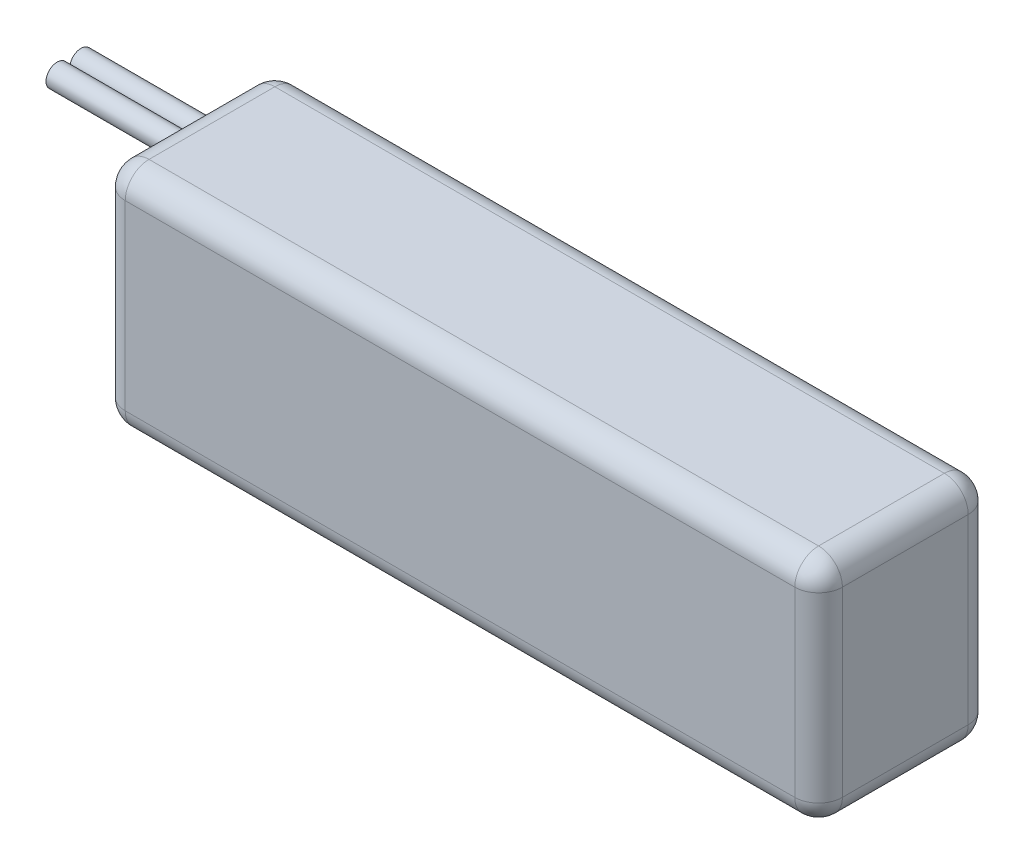
ISO-10303-21;
HEADER;
FILE_DESCRIPTION(('STEP AP214'),'2;1');
FILE_NAME('part.step','',(''),(''),'','','');
FILE_SCHEMA(('AUTOMOTIVE_DESIGN { 1 0 10303 214 1 1 1 1 }'));
ENDSEC;
DATA;
#1=APPLICATION_CONTEXT('core data for automotive mechanical design processes');
#2=APPLICATION_PROTOCOL_DEFINITION('international standard','automotive_design',2000,#1);
#3=PRODUCT_CONTEXT('',#1,'mechanical');
#4=PRODUCT('Part','Part','',(#3));
#5=PRODUCT_RELATED_PRODUCT_CATEGORY('part','',(#4));
#6=PRODUCT_DEFINITION_FORMATION('','',#4);
#7=PRODUCT_DEFINITION_CONTEXT('part definition',#1,'design');
#8=PRODUCT_DEFINITION('design','',#6,#7);
#9=PRODUCT_DEFINITION_SHAPE('','',#8);
#10=(LENGTH_UNIT() NAMED_UNIT(*) SI_UNIT(.MILLI.,.METRE.));
#11=(NAMED_UNIT(*) PLANE_ANGLE_UNIT() SI_UNIT($,.RADIAN.));
#12=(NAMED_UNIT(*) SI_UNIT($,.STERADIAN.) SOLID_ANGLE_UNIT());
#13=UNCERTAINTY_MEASURE_WITH_UNIT(LENGTH_MEASURE(1.E-05),#10,'distance_accuracy_value','');
#14=(GEOMETRIC_REPRESENTATION_CONTEXT(3) GLOBAL_UNCERTAINTY_ASSIGNED_CONTEXT((#13)) GLOBAL_UNIT_ASSIGNED_CONTEXT((#10,
#11,#12)) REPRESENTATION_CONTEXT('',''));
#15=CARTESIAN_POINT('',(0.,0.,0.));
#16=DIRECTION('',(0.,0.,1.));
#17=DIRECTION('',(1.,0.,0.));
#18=AXIS2_PLACEMENT_3D('',#15,#16,#17);
#19=CARTESIAN_POINT('',(0.,49.,0.));
#20=DIRECTION('',(1.,0.,0.));
#21=DIRECTION('',(0.,0.,-1.));
#22=AXIS2_PLACEMENT_3D('',#19,#20,#21);
#23=PLANE('',#22);
#24=DIRECTION('',(0.,0.,1.));
#25=VECTOR('',#24,1.);
#26=CARTESIAN_POINT('',(0.,43.92,0.));
#27=LINE('',#26,#25);
#28=CARTESIAN_POINT('',(0.,43.92,31.92));
#29=VERTEX_POINT('',#28);
#30=CARTESIAN_POINT('',(0.,43.92,23.42125));
#31=VERTEX_POINT('',#30);
#32=EDGE_CURVE('E141',#29,#31,#27,.F.);
#33=ORIENTED_EDGE('',*,*,#32,.T.);
#34=CARTESIAN_POINT('',(0.,43.92,21.04));
#35=DIRECTION('',(1.,0.,0.));
#36=DIRECTION('',(0.,0.,-1.));
#37=AXIS2_PLACEMENT_3D('',#34,#35,#36);
#38=CIRCLE('',#37,2.38125);
#39=CARTESIAN_POINT('',(0.,43.92,18.65875));
#40=VERTEX_POINT('',#39);
#41=EDGE_CURVE('E145',#31,#40,#38,.T.);
#42=ORIENTED_EDGE('',*,*,#41,.T.);
#43=CARTESIAN_POINT('',(0.,43.92,18.34125));
#44=VERTEX_POINT('',#43);
#45=EDGE_CURVE('E60',#40,#44,#27,.F.);
#46=ORIENTED_EDGE('',*,*,#45,.T.);
#47=CARTESIAN_POINT('',(0.,43.92,15.96));
#48=DIRECTION('',(1.,0.,0.));
#49=DIRECTION('',(0.,0.,-1.));
#50=AXIS2_PLACEMENT_3D('',#47,#48,#49);
#51=CIRCLE('',#50,2.38125);
#52=CARTESIAN_POINT('',(0.,43.92,13.57875));
#53=VERTEX_POINT('',#52);
#54=EDGE_CURVE('E338',#44,#53,#51,.T.);
#55=ORIENTED_EDGE('',*,*,#54,.T.);
#56=CARTESIAN_POINT('',(0.,43.92,5.08));
#57=VERTEX_POINT('',#56);
#58=EDGE_CURVE('E142',#53,#57,#27,.F.);
#59=ORIENTED_EDGE('',*,*,#58,.T.);
#60=DIRECTION('',(0.,-1.,0.));
#61=VECTOR('',#60,1.);
#62=CARTESIAN_POINT('',(0.,49.,5.08));
#63=LINE('',#62,#61);
#64=CARTESIAN_POINT('',(0.,5.08,5.08));
#65=VERTEX_POINT('',#64);
#66=EDGE_CURVE('E331',#57,#65,#63,.T.);
#67=ORIENTED_EDGE('',*,*,#66,.T.);
#68=DIRECTION('',(0.,0.,1.));
#69=VECTOR('',#68,1.);
#70=CARTESIAN_POINT('',(0.,5.08,0.));
#71=LINE('',#70,#69);
#72=CARTESIAN_POINT('',(0.,5.08,31.92));
#73=VERTEX_POINT('',#72);
#74=EDGE_CURVE('E246',#65,#73,#71,.T.);
#75=ORIENTED_EDGE('',*,*,#74,.T.);
#76=DIRECTION('',(0.,-1.,0.));
#77=VECTOR('',#76,1.);
#78=CARTESIAN_POINT('',(0.,49.,31.92));
#79=LINE('',#78,#77);
#80=EDGE_CURVE('E329',#73,#29,#79,.F.);
#81=ORIENTED_EDGE('',*,*,#80,.T.);
#82=EDGE_LOOP('',(#33,#42,#46,#55,#59,#67,#75,#81));
#83=FACE_BOUND('',#82,.T.);
#84=ADVANCED_FACE('F36',(#83),#23,.F.);
#85=CARTESIAN_POINT('',(0.,49.,37.));
#86=DIRECTION('',(0.,0.,-1.));
#87=DIRECTION('',(-1.,0.,0.));
#88=AXIS2_PLACEMENT_3D('',#85,#86,#87);
#89=PLANE('',#88);
#90=DIRECTION('',(1.,0.,0.));
#91=VECTOR('',#90,1.);
#92=CARTESIAN_POINT('',(0.,5.08,37.));
#93=LINE('',#92,#91);
#94=CARTESIAN_POINT('',(5.08,5.08,37.));
#95=VERTEX_POINT('',#94);
#96=CARTESIAN_POINT('',(147.92,5.08,37.));
#97=VERTEX_POINT('',#96);
#98=EDGE_CURVE('E303',#95,#97,#93,.T.);
#99=ORIENTED_EDGE('',*,*,#98,.T.);
#100=DIRECTION('',(0.,-1.,0.));
#101=VECTOR('',#100,1.);
#102=CARTESIAN_POINT('',(147.92,49.,37.));
#103=LINE('',#102,#101);
#104=CARTESIAN_POINT('',(147.92,43.92,37.));
#105=VERTEX_POINT('',#104);
#106=EDGE_CURVE('E286',#97,#105,#103,.F.);
#107=ORIENTED_EDGE('',*,*,#106,.T.);
#108=DIRECTION('',(1.,0.,0.));
#109=VECTOR('',#108,1.);
#110=CARTESIAN_POINT('',(0.,43.92,37.));
#111=LINE('',#110,#109);
#112=CARTESIAN_POINT('',(5.08,43.92,37.));
#113=VERTEX_POINT('',#112);
#114=EDGE_CURVE('E308',#105,#113,#111,.F.);
#115=ORIENTED_EDGE('',*,*,#114,.T.);
#116=DIRECTION('',(0.,-1.,0.));
#117=VECTOR('',#116,1.);
#118=CARTESIAN_POINT('',(5.08,49.,37.));
#119=LINE('',#118,#117);
#120=EDGE_CURVE('E301',#113,#95,#119,.T.);
#121=ORIENTED_EDGE('',*,*,#120,.T.);
#122=EDGE_LOOP('',(#99,#107,#115,#121));
#123=FACE_BOUND('',#122,.T.);
#124=ADVANCED_FACE('F167',(#123),#89,.F.);
#125=CARTESIAN_POINT('',(153.,49.,0.));
#126=DIRECTION('',(-1.,0.,0.));
#127=DIRECTION('',(0.,0.,1.));
#128=AXIS2_PLACEMENT_3D('',#125,#126,#127);
#129=PLANE('',#128);
#130=DIRECTION('',(0.,-1.,0.));
#131=VECTOR('',#130,1.);
#132=CARTESIAN_POINT('',(153.,49.,31.92));
#133=LINE('',#132,#131);
#134=CARTESIAN_POINT('',(153.,43.92,31.92));
#135=VERTEX_POINT('',#134);
#136=CARTESIAN_POINT('',(153.,5.08,31.92));
#137=VERTEX_POINT('',#136);
#138=EDGE_CURVE('E269',#135,#137,#133,.T.);
#139=ORIENTED_EDGE('',*,*,#138,.T.);
#140=DIRECTION('',(0.,0.,-1.));
#141=VECTOR('',#140,1.);
#142=CARTESIAN_POINT('',(153.,5.08,0.));
#143=LINE('',#142,#141);
#144=CARTESIAN_POINT('',(153.,5.08,5.08));
#145=VERTEX_POINT('',#144);
#146=EDGE_CURVE('E273',#137,#145,#143,.T.);
#147=ORIENTED_EDGE('',*,*,#146,.T.);
#148=DIRECTION('',(0.,-1.,0.));
#149=VECTOR('',#148,1.);
#150=CARTESIAN_POINT('',(153.,49.,5.08));
#151=LINE('',#150,#149);
#152=CARTESIAN_POINT('',(153.,43.92,5.08));
#153=VERTEX_POINT('',#152);
#154=EDGE_CURVE('E279',#145,#153,#151,.F.);
#155=ORIENTED_EDGE('',*,*,#154,.T.);
#156=DIRECTION('',(0.,0.,-1.));
#157=VECTOR('',#156,1.);
#158=CARTESIAN_POINT('',(153.,43.92,37.));
#159=LINE('',#158,#157);
#160=EDGE_CURVE('E276',#153,#135,#159,.F.);
#161=ORIENTED_EDGE('',*,*,#160,.T.);
#162=EDGE_LOOP('',(#139,#147,#155,#161));
#163=FACE_BOUND('',#162,.T.);
#164=ADVANCED_FACE('F172',(#163),#129,.F.);
#165=CARTESIAN_POINT('',(0.,49.,0.));
#166=DIRECTION('',(0.,0.,1.));
#167=DIRECTION('',(1.,0.,0.));
#168=AXIS2_PLACEMENT_3D('',#165,#166,#167);
#169=PLANE('',#168);
#170=DIRECTION('',(-1.,0.,0.));
#171=VECTOR('',#170,1.);
#172=CARTESIAN_POINT('',(153.,43.92,0.));
#173=LINE('',#172,#171);
#174=CARTESIAN_POINT('',(5.08,43.92,0.));
#175=VERTEX_POINT('',#174);
#176=CARTESIAN_POINT('',(147.92,43.92,0.));
#177=VERTEX_POINT('',#176);
#178=EDGE_CURVE('E399',#175,#177,#173,.F.);
#179=ORIENTED_EDGE('',*,*,#178,.T.);
#180=DIRECTION('',(0.,-1.,0.));
#181=VECTOR('',#180,1.);
#182=CARTESIAN_POINT('',(147.92,49.,0.));
#183=LINE('',#182,#181);
#184=CARTESIAN_POINT('',(147.92,5.08,0.));
#185=VERTEX_POINT('',#184);
#186=EDGE_CURVE('E405',#177,#185,#183,.T.);
#187=ORIENTED_EDGE('',*,*,#186,.T.);
#188=DIRECTION('',(-1.,0.,0.));
#189=VECTOR('',#188,1.);
#190=CARTESIAN_POINT('',(0.,5.08,0.));
#191=LINE('',#190,#189);
#192=CARTESIAN_POINT('',(5.08,5.08,0.));
#193=VERTEX_POINT('',#192);
#194=EDGE_CURVE('E395',#185,#193,#191,.T.);
#195=ORIENTED_EDGE('',*,*,#194,.T.);
#196=DIRECTION('',(0.,-1.,0.));
#197=VECTOR('',#196,1.);
#198=CARTESIAN_POINT('',(5.08,49.,0.));
#199=LINE('',#198,#197);
#200=EDGE_CURVE('E390',#193,#175,#199,.F.);
#201=ORIENTED_EDGE('',*,*,#200,.T.);
#202=EDGE_LOOP('',(#179,#187,#195,#201));
#203=FACE_BOUND('',#202,.T.);
#204=ADVANCED_FACE('F257',(#203),#169,.F.);
#205=CARTESIAN_POINT('',(0.,49.,0.));
#206=DIRECTION('',(0.,1.,0.));
#207=DIRECTION('',(0.,0.,1.));
#208=AXIS2_PLACEMENT_3D('',#205,#206,#207);
#209=PLANE('',#208);
#210=DIRECTION('',(1.,0.,0.));
#211=VECTOR('',#210,1.);
#212=CARTESIAN_POINT('',(153.,49.,31.92));
#213=LINE('',#212,#211);
#214=CARTESIAN_POINT('',(5.08,49.,31.92));
#215=VERTEX_POINT('',#214);
#216=CARTESIAN_POINT('',(147.92,49.,31.92));
#217=VERTEX_POINT('',#216);
#218=EDGE_CURVE('E322',#215,#217,#213,.T.);
#219=ORIENTED_EDGE('',*,*,#218,.T.);
#220=DIRECTION('',(0.,0.,-1.));
#221=VECTOR('',#220,1.);
#222=CARTESIAN_POINT('',(147.92,49.,0.));
#223=LINE('',#222,#221);
#224=CARTESIAN_POINT('',(147.92,49.,5.08));
#225=VERTEX_POINT('',#224);
#226=EDGE_CURVE('E326',#217,#225,#223,.T.);
#227=ORIENTED_EDGE('',*,*,#226,.T.);
#228=DIRECTION('',(-1.,0.,0.));
#229=VECTOR('',#228,1.);
#230=CARTESIAN_POINT('',(0.,49.,5.08));
#231=LINE('',#230,#229);
#232=CARTESIAN_POINT('',(5.08,49.,5.08));
#233=VERTEX_POINT('',#232);
#234=EDGE_CURVE('E324',#225,#233,#231,.T.);
#235=ORIENTED_EDGE('',*,*,#234,.T.);
#236=DIRECTION('',(0.,0.,1.));
#237=VECTOR('',#236,1.);
#238=CARTESIAN_POINT('',(5.08,49.,37.));
#239=LINE('',#238,#237);
#240=EDGE_CURVE('E320',#233,#215,#239,.T.);
#241=ORIENTED_EDGE('',*,*,#240,.T.);
#242=EDGE_LOOP('',(#219,#227,#235,#241));
#243=FACE_BOUND('',#242,.T.);
#244=ADVANCED_FACE('F253',(#243),#209,.T.);
#245=CARTESIAN_POINT('',(0.,0.,0.));
#246=DIRECTION('',(0.,1.,0.));
#247=DIRECTION('',(0.,0.,1.));
#248=AXIS2_PLACEMENT_3D('',#245,#246,#247);
#249=PLANE('',#248);
#250=DIRECTION('',(-1.,0.,0.));
#251=VECTOR('',#250,1.);
#252=CARTESIAN_POINT('',(0.,0.,5.08));
#253=LINE('',#252,#251);
#254=CARTESIAN_POINT('',(5.08,0.,5.08));
#255=VERTEX_POINT('',#254);
#256=CARTESIAN_POINT('',(147.92,0.,5.08));
#257=VERTEX_POINT('',#256);
#258=EDGE_CURVE('E313',#255,#257,#253,.F.);
#259=ORIENTED_EDGE('',*,*,#258,.T.);
#260=DIRECTION('',(0.,0.,-1.));
#261=VECTOR('',#260,1.);
#262=CARTESIAN_POINT('',(147.92,0.,-1.10962290407131E-13));
#263=LINE('',#262,#261);
#264=CARTESIAN_POINT('',(147.92,0.,31.92));
#265=VERTEX_POINT('',#264);
#266=EDGE_CURVE('E317',#257,#265,#263,.F.);
#267=ORIENTED_EDGE('',*,*,#266,.T.);
#268=DIRECTION('',(1.,0.,0.));
#269=VECTOR('',#268,1.);
#270=CARTESIAN_POINT('',(0.,0.,31.92));
#271=LINE('',#270,#269);
#272=CARTESIAN_POINT('',(5.08,0.,31.92));
#273=VERTEX_POINT('',#272);
#274=EDGE_CURVE('E315',#265,#273,#271,.F.);
#275=ORIENTED_EDGE('',*,*,#274,.T.);
#276=DIRECTION('',(0.,0.,1.));
#277=VECTOR('',#276,1.);
#278=CARTESIAN_POINT('',(5.08,0.,0.));
#279=LINE('',#278,#277);
#280=EDGE_CURVE('E311',#273,#255,#279,.F.);
#281=ORIENTED_EDGE('',*,*,#280,.T.);
#282=EDGE_LOOP('',(#259,#267,#275,#281));
#283=FACE_BOUND('',#282,.T.);
#284=ADVANCED_FACE('F256',(#283),#249,.F.);
#285=CARTESIAN_POINT('',(5.08,49.,31.92));
#286=DIRECTION('',(0.,-1.,0.));
#287=DIRECTION('',(0.,0.,-1.));
#288=AXIS2_PLACEMENT_3D('',#285,#286,#287);
#289=CYLINDRICAL_SURFACE('',#288,5.08);
#290=CARTESIAN_POINT('',(5.08,43.92,31.92));
#291=DIRECTION('',(0.,1.,0.));
#292=DIRECTION('',(0.,0.,1.));
#293=AXIS2_PLACEMENT_3D('',#290,#291,#292);
#294=CIRCLE('',#293,5.08);
#295=EDGE_CURVE('E247',#29,#113,#294,.T.);
#296=ORIENTED_EDGE('',*,*,#295,.F.);
#297=ORIENTED_EDGE('',*,*,#80,.F.);
#298=CARTESIAN_POINT('',(5.08,5.08,31.92));
#299=DIRECTION('',(0.,-1.,0.));
#300=DIRECTION('',(0.,0.,-1.));
#301=AXIS2_PLACEMENT_3D('',#298,#299,#300);
#302=CIRCLE('',#301,5.08);
#303=EDGE_CURVE('E382',#95,#73,#302,.T.);
#304=ORIENTED_EDGE('',*,*,#303,.F.);
#305=ORIENTED_EDGE('',*,*,#120,.F.);
#306=EDGE_LOOP('',(#296,#297,#304,#305));
#307=FACE_BOUND('',#306,.T.);
#308=ADVANCED_FACE('F38',(#307),#289,.T.);
#309=CARTESIAN_POINT('',(5.08,43.92,31.92));
#310=DIRECTION('',(0.,0.,1.));
#311=DIRECTION('',(1.,0.,0.));
#312=AXIS2_PLACEMENT_3D('',#309,#310,#311);
#313=SPHERICAL_SURFACE('',#312,5.08);
#314=CARTESIAN_POINT('',(5.08,43.92,31.92));
#315=DIRECTION('',(0.,0.,1.));
#316=DIRECTION('',(1.,0.,0.));
#317=AXIS2_PLACEMENT_3D('',#314,#315,#316);
#318=CIRCLE('',#317,5.08);
#319=EDGE_CURVE('E377',#29,#215,#318,.F.);
#320=ORIENTED_EDGE('',*,*,#319,.F.);
#321=ORIENTED_EDGE('',*,*,#295,.T.);
#322=CARTESIAN_POINT('',(5.08,43.92,31.92));
#323=DIRECTION('',(-1.,0.,0.));
#324=DIRECTION('',(0.,-1.,0.));
#325=AXIS2_PLACEMENT_3D('',#322,#323,#324);
#326=CIRCLE('',#325,5.08);
#327=EDGE_CURVE('E380',#215,#113,#326,.F.);
#328=ORIENTED_EDGE('',*,*,#327,.F.);
#329=EDGE_LOOP('',(#320,#321,#328));
#330=FACE_BOUND('',#329,.T.);
#331=ADVANCED_FACE('F435',(#330),#313,.T.);
#332=CARTESIAN_POINT('',(5.08,5.08,31.92));
#333=DIRECTION('',(0.,0.,1.));
#334=DIRECTION('',(1.,0.,0.));
#335=AXIS2_PLACEMENT_3D('',#332,#333,#334);
#336=SPHERICAL_SURFACE('',#335,5.08);
#337=CARTESIAN_POINT('',(5.08,5.08,31.92));
#338=DIRECTION('',(-1.,0.,0.));
#339=DIRECTION('',(0.,0.,1.));
#340=AXIS2_PLACEMENT_3D('',#337,#338,#339);
#341=CIRCLE('',#340,5.08);
#342=EDGE_CURVE('E372',#95,#273,#341,.F.);
#343=ORIENTED_EDGE('',*,*,#342,.F.);
#344=ORIENTED_EDGE('',*,*,#303,.T.);
#345=CARTESIAN_POINT('',(5.08,5.08,31.92));
#346=DIRECTION('',(0.,0.,1.));
#347=DIRECTION('',(1.,0.,0.));
#348=AXIS2_PLACEMENT_3D('',#345,#346,#347);
#349=CIRCLE('',#348,5.08);
#350=EDGE_CURVE('E375',#273,#73,#349,.F.);
#351=ORIENTED_EDGE('',*,*,#350,.F.);
#352=EDGE_LOOP('',(#343,#344,#351));
#353=FACE_BOUND('',#352,.T.);
#354=ADVANCED_FACE('F437',(#353),#336,.T.);
#355=CARTESIAN_POINT('',(0.,43.92,31.92));
#356=DIRECTION('',(-1.,0.,0.));
#357=DIRECTION('',(0.,0.,1.));
#358=AXIS2_PLACEMENT_3D('',#355,#356,#357);
#359=CYLINDRICAL_SURFACE('',#358,5.08);
#360=ORIENTED_EDGE('',*,*,#327,.T.);
#361=ORIENTED_EDGE('',*,*,#114,.F.);
#362=CARTESIAN_POINT('',(147.92,43.92,31.92));
#363=DIRECTION('',(1.,0.,0.));
#364=DIRECTION('',(0.,0.,-1.));
#365=AXIS2_PLACEMENT_3D('',#362,#363,#364);
#366=CIRCLE('',#365,5.08);
#367=EDGE_CURVE('E368',#217,#105,#366,.T.);
#368=ORIENTED_EDGE('',*,*,#367,.F.);
#369=ORIENTED_EDGE('',*,*,#218,.F.);
#370=EDGE_LOOP('',(#360,#361,#368,#369));
#371=FACE_BOUND('',#370,.T.);
#372=ADVANCED_FACE('F239',(#371),#359,.T.);
#373=CARTESIAN_POINT('',(5.08,43.92,0.));
#374=DIRECTION('',(0.,0.,-1.));
#375=DIRECTION('',(-1.,0.,0.));
#376=AXIS2_PLACEMENT_3D('',#373,#374,#375);
#377=CYLINDRICAL_SURFACE('',#376,5.08);
#378=CARTESIAN_POINT('',(0.,43.92,23.42125));
#379=CARTESIAN_POINT('',(6.66751126377111E-06,44.0461030678718,23.4212419566849));
#380=CARTESIAN_POINT('',(0.00474750865264298,44.1723880812394,23.4111732828898));
#381=CARTESIAN_POINT('',(0.023244636523619,44.4212810356049,23.3713142884802));
#382=CARTESIAN_POINT('',(0.0370207261469717,44.5438802796551,23.3414806467847));
#383=CARTESIAN_POINT('',(0.0721336023674859,44.7814148021554,23.2634839952844));
#384=CARTESIAN_POINT('',(0.0934422842846373,44.8963767073086,23.2153890709597));
#385=CARTESIAN_POINT('',(0.141619624718228,45.1164564396619,23.1025588240147));
#386=CARTESIAN_POINT('',(0.168487382233147,45.2215758581031,23.0378261975815));
#387=CARTESIAN_POINT('',(0.22698892521994,45.4255061776356,22.8894770668307));
#388=CARTESIAN_POINT('',(0.258803706965461,45.5236507428597,22.8050168571231));
#389=CARTESIAN_POINT('',(0.32295162640306,45.7049815963756,22.6214106616557));
#390=CARTESIAN_POINT('',(0.355285093125134,45.788157944948,22.5222549964041));
#391=CARTESIAN_POINT('',(0.419239964560849,45.9426632319388,22.3041951583329));
#392=CARTESIAN_POINT('',(0.450673773594214,46.0128490482213,22.1844198340709));
#393=CARTESIAN_POINT('',(0.506298986047624,46.1317867750302,21.9331072744446));
#394=CARTESIAN_POINT('',(0.530495046025748,46.1805524761404,21.8015776725026));
#395=CARTESIAN_POINT('',(0.566894334930618,46.2523433125274,21.5380960310609));
#396=CARTESIAN_POINT('',(0.579694408171674,46.2766594470889,21.4065819632844));
#397=CARTESIAN_POINT('',(0.59350365308562,46.3028543332485,21.1407673985273));
#398=CARTESIAN_POINT('',(0.594522152656619,46.304750835307,21.006469190265));
#399=CARTESIAN_POINT('',(0.585143920979396,46.2870079049233,20.7535711448624));
#400=CARTESIAN_POINT('',(0.575899986147013,46.2695435937815,20.6347663106757));
#401=CARTESIAN_POINT('',(0.549030510462143,46.2172960960267,20.4020236671996));
#402=CARTESIAN_POINT('',(0.531402787606297,46.1825084006389,20.2880871333748));
#403=CARTESIAN_POINT('',(0.489344770274719,46.0959220904643,20.0651387166347));
#404=CARTESIAN_POINT('',(0.464766737358207,46.0437490726996,19.9563013999583));
#405=CARTESIAN_POINT('',(0.411588410976883,45.9241484869647,19.7484369304834));
#406=CARTESIAN_POINT('',(0.382986357035547,45.8567142344275,19.6494141039374));
#407=CARTESIAN_POINT('',(0.321181982915465,45.6998596690143,19.4525572054004));
#408=CARTESIAN_POINT('',(0.287819147520031,45.6088392775379,19.3560442901392));
#409=CARTESIAN_POINT('',(0.222834261713092,45.4116811789871,19.1791431789638));
#410=CARTESIAN_POINT('',(0.191212862773998,45.3055378669742,19.0987609882282));
#411=CARTESIAN_POINT('',(0.131861192473406,45.0762143149451,18.9537181470265));
#412=CARTESIAN_POINT('',(0.104313411041528,44.9525561404361,18.8897326255739));
#413=CARTESIAN_POINT('',(0.0576989511461022,44.6946082866233,18.7839579174467));
#414=CARTESIAN_POINT('',(0.0386263277348119,44.5603261377046,18.7421531679371));
#415=CARTESIAN_POINT('',(0.012314025111575,44.2958533832674,18.685009207939));
#416=CARTESIAN_POINT('',(0.00428786190068203,44.1661225969004,18.6679060602172));
#417=CARTESIAN_POINT('',(-0.00164953499662754,43.9054024801508,18.6552249693106));
#418=CARTESIAN_POINT('',(0.000435256319284717,43.7744136645569,18.6596385670848));
#419=CARTESIAN_POINT('',(0.0140021276029588,43.5240806356016,18.6887391269643));
#420=CARTESIAN_POINT('',(0.0248530905220521,43.4045395295678,18.7120649086242));
#421=CARTESIAN_POINT('',(0.0541047653893851,43.1712653541252,18.7762886590634));
#422=CARTESIAN_POINT('',(0.0725063578287522,43.0575329638201,18.817188677229));
#423=CARTESIAN_POINT('',(0.115859614462322,42.8351285751517,18.9166298922253));
#424=CARTESIAN_POINT('',(0.140994268668439,42.7267174503632,18.9756720212303));
#425=CARTESIAN_POINT('',(0.19528675270719,42.5209582170742,19.1091733111719));
#426=CARTESIAN_POINT('',(0.224446347907857,42.4236149973919,19.1836392443135));
#427=CARTESIAN_POINT('',(0.286933433916928,42.2336504025676,19.3535196712354));
#428=CARTESIAN_POINT('',(0.320401416911226,42.1422089144573,19.4502047307659));
#429=CARTESIAN_POINT('',(0.385668578176108,41.9763924901376,19.6578264348214));
#430=CARTESIAN_POINT('',(0.417466933080163,41.9020259144623,19.7687700195787));
#431=CARTESIAN_POINT('',(0.476704215164317,41.7702382090416,20.0065818821403));
#432=CARTESIAN_POINT('',(0.503962470636643,41.7134646447281,20.1338577465442));
#433=CARTESIAN_POINT('',(0.548822429255224,41.6227332925937,20.3978614857355));
#434=CARTESIAN_POINT('',(0.56643492773741,41.5887499887673,20.5345786002166));
#435=CARTESIAN_POINT('',(0.588051007385053,41.5473876489804,20.8002725703437));
#436=CARTESIAN_POINT('',(0.593142938194965,41.5378773088053,20.9288285495007));
#437=CARTESIAN_POINT('',(0.59214883258969,41.5397480527593,21.1857266389945));
#438=CARTESIAN_POINT('',(0.586066019847235,41.5511231119002,21.3140688003229));
#439=CARTESIAN_POINT('',(0.564505159667843,41.5925165467159,21.5569381110853));
#440=CARTESIAN_POINT('',(0.549757553857693,41.6210893059697,21.6717838173011));
#441=CARTESIAN_POINT('',(0.513281456767811,41.6944327402588,21.8949930661474));
#442=CARTESIAN_POINT('',(0.491550879067994,41.7392082569697,22.0033546599173));
#443=CARTESIAN_POINT('',(0.441781889526168,41.8470610805539,22.2184301114576));
#444=CARTESIAN_POINT('',(0.413420496819863,41.9111560320376,22.3245570322692));
#445=CARTESIAN_POINT('',(0.354254349352318,42.0545920138815,22.5252043402943));
#446=CARTESIAN_POINT('',(0.323448447733663,42.1339402255398,22.6197192260214));
#447=CARTESIAN_POINT('',(0.259112531443435,42.3151389713669,22.8044123544138));
#448=CARTESIAN_POINT('',(0.225623783139015,42.4184567378506,22.8931740890071));
#449=CARTESIAN_POINT('',(0.162670668937866,42.6395708117861,23.0523188355914));
#450=CARTESIAN_POINT('',(0.13320823152119,42.7573740063546,23.1226930551372));
#451=CARTESIAN_POINT('',(0.0816539771751225,43.0042046240895,23.2423474147258));
#452=CARTESIAN_POINT('',(0.0595282287993208,43.1331767947826,23.2917249705768));
#453=CARTESIAN_POINT('',(0.0336795488105614,43.3321592185232,23.3485857569652));
#454=CARTESIAN_POINT('',(0.0262895244817493,43.399353425859,23.3646659722558));
#455=CARTESIAN_POINT('',(0.0141458685174156,43.5351013309582,23.3909510007653));
#456=CARTESIAN_POINT('',(0.00939049921135813,43.6036541017082,23.401159686685));
#457=CARTESIAN_POINT('',(0.00402660558461075,43.7136328457326,23.4126505267818));
#458=CARTESIAN_POINT('',(0.00251885237665859,43.7548239331376,23.415872903296));
#459=CARTESIAN_POINT('',(0.000504446292885419,43.8373368268763,23.420173980541));
#460=CARTESIAN_POINT('',(-2.18586284205595E-06,43.8786586358979,23.4212526369035));
#461=CARTESIAN_POINT('',(0.,43.92,23.42125));
#462=B_SPLINE_CURVE_WITH_KNOTS('',3,(#378,#379,#380,#381,#382,#383,#384,#385,#386,#387,#388,
#389,#390,#391,#392,#393,#394,#395,#396,#397,#398,#399,#400,#401,#402,#403,#404,#405,#406,#407,
#408,#409,#410,#411,#412,#413,#414,#415,#416,#417,#418,#419,#420,#421,#422,#423,#424,#425,#426,
#427,#428,#429,#430,#431,#432,#433,#434,#435,#436,#437,#438,#439,#440,#441,#442,#443,#444,#445,
#446,#447,#448,#449,#450,#451,#452,#453,#454,#455,#456,#457,#458,#459,#460,#461),.UNSPECIFIED.,
.T.,.F.,(4,2,2,2,2,2,2,2,2,2,2,2,2,2,2,2,2,2,2,2,2,2,2,2,2,2,2,2,2,2,2,2,2,2,2,2,2,2,2,2,2,4),
(0.,0.37814805797876,0.757127699429006,1.13470800922117,1.51222716958168,1.91053904626906,
2.30911445570845,2.7339762281225,3.15856406594302,3.55932352979642,3.95976567614627,
4.31939704759326,4.67912206962384,5.04715706198695,5.41535357027342,5.82392678356032,
6.23265182028176,6.65618547554391,7.07942156992264,7.4706174806857,7.8616596100476,
8.22681959872753,8.59202218141163,8.96838571289987,9.34491484780605,9.75475973263294,
10.1648048673644,10.5885198151477,11.0117595755854,11.3966557856313,11.7814409788491,
12.1376816334603,12.4940288272133,12.8740322606283,13.2542150413526,13.6730287455118,
14.0920423508026,14.5090901151527,14.7172930042089,14.925358410361,15.0493271072816,
15.1732983699419),.UNSPECIFIED.);
#463=EDGE_CURVE('E11',#31,#40,#462,.T.);
#464=ORIENTED_EDGE('',*,*,#463,.F.);
#465=ORIENTED_EDGE('',*,*,#32,.F.);
#466=ORIENTED_EDGE('',*,*,#319,.T.);
#467=ORIENTED_EDGE('',*,*,#240,.F.);
#468=CARTESIAN_POINT('',(5.08,43.92,5.08));
#469=DIRECTION('',(0.,0.,-1.));
#470=DIRECTION('',(-1.,0.,0.));
#471=AXIS2_PLACEMENT_3D('',#468,#469,#470);
#472=CIRCLE('',#471,5.08);
#473=EDGE_CURVE('E365',#57,#233,#472,.T.);
#474=ORIENTED_EDGE('',*,*,#473,.F.);
#475=ORIENTED_EDGE('',*,*,#58,.F.);
#476=CARTESIAN_POINT('',(0.,43.92,18.34125));
#477=CARTESIAN_POINT('',(6.66751126306753E-06,44.0461030678718,18.3412419566849));
#478=CARTESIAN_POINT('',(0.00474750865264296,44.1723880812394,18.3311732828898));
#479=CARTESIAN_POINT('',(0.0232446365236191,44.4212810356049,18.2913142884802));
#480=CARTESIAN_POINT('',(0.0370207261469713,44.5438802796551,18.2614806467847));
#481=CARTESIAN_POINT('',(0.0721336023674851,44.7814148021554,18.1834839952844));
#482=CARTESIAN_POINT('',(0.0934422842846366,44.8963767073086,18.1353890709597));
#483=CARTESIAN_POINT('',(0.141619624718227,45.1164564396619,18.0225588240147));
#484=CARTESIAN_POINT('',(0.168487382233146,45.2215758581031,17.9578261975815));
#485=CARTESIAN_POINT('',(0.226988925219939,45.4255061776356,17.8094770668307));
#486=CARTESIAN_POINT('',(0.25880370696546,45.5236507428597,17.7250168571231));
#487=CARTESIAN_POINT('',(0.322951626403058,45.7049815963756,17.5414106616557));
#488=CARTESIAN_POINT('',(0.355285093125133,45.788157944948,17.4422549964041));
#489=CARTESIAN_POINT('',(0.419239964560848,45.9426632319388,17.2241951583329));
#490=CARTESIAN_POINT('',(0.450673773594214,46.0128490482213,17.1044198340709));
#491=CARTESIAN_POINT('',(0.506298986047624,46.1317867750302,16.8531072744446));
#492=CARTESIAN_POINT('',(0.530495046025748,46.1805524761404,16.7215776725026));
#493=CARTESIAN_POINT('',(0.566894334930617,46.2523433125274,16.4580960310609));
#494=CARTESIAN_POINT('',(0.579694408171673,46.2766594470889,16.3265819632844));
#495=CARTESIAN_POINT('',(0.593503653085618,46.3028543332485,16.0607673985273));
#496=CARTESIAN_POINT('',(0.594522152656618,46.304750835307,15.926469190265));
#497=CARTESIAN_POINT('',(0.585143920979395,46.2870079049233,15.6735711448624));
#498=CARTESIAN_POINT('',(0.575899986147012,46.2695435937815,15.5547663106756));
#499=CARTESIAN_POINT('',(0.549030510462142,46.2172960960267,15.3220236671996));
#500=CARTESIAN_POINT('',(0.531402787606296,46.1825084006389,15.2080871333748));
#501=CARTESIAN_POINT('',(0.489344770274718,46.0959220904643,14.9851387166347));
#502=CARTESIAN_POINT('',(0.464766737358206,46.0437490726996,14.8763013999583));
#503=CARTESIAN_POINT('',(0.411588410976882,45.9241484869647,14.6684369304834));
#504=CARTESIAN_POINT('',(0.382986357035546,45.8567142344275,14.5694141039374));
#505=CARTESIAN_POINT('',(0.321181982915465,45.6998596690143,14.3725572054004));
#506=CARTESIAN_POINT('',(0.287819147520031,45.6088392775379,14.2760442901393));
#507=CARTESIAN_POINT('',(0.222834261713092,45.4116811789871,14.0991431789638));
#508=CARTESIAN_POINT('',(0.191212862773999,45.3055378669742,14.0187609882282));
#509=CARTESIAN_POINT('',(0.131861192473407,45.0762143149451,13.8737181470265));
#510=CARTESIAN_POINT('',(0.104313411041528,44.9525561404361,13.8097326255739));
#511=CARTESIAN_POINT('',(0.0576989511461015,44.6946082866233,13.7039579174467));
#512=CARTESIAN_POINT('',(0.0386263277348112,44.5603261377046,13.6621531679371));
#513=CARTESIAN_POINT('',(0.0123140251115743,44.2958533832674,13.605009207939));
#514=CARTESIAN_POINT('',(0.00428786190068108,44.1661225969004,13.5879060602172));
#515=CARTESIAN_POINT('',(-0.00164953499662833,43.9054024801508,13.5752249693106));
#516=CARTESIAN_POINT('',(0.000435256319284315,43.7744136645569,13.5796385670848));
#517=CARTESIAN_POINT('',(0.0140021276029586,43.5240806356016,13.6087391269643));
#518=CARTESIAN_POINT('',(0.0248530905220521,43.4045395295678,13.6320649086242));
#519=CARTESIAN_POINT('',(0.0541047653893848,43.1712653541252,13.6962886590634));
#520=CARTESIAN_POINT('',(0.0725063578287513,43.0575329638201,13.737188677229));
#521=CARTESIAN_POINT('',(0.115859614462322,42.8351285751517,13.8366298922253));
#522=CARTESIAN_POINT('',(0.140994268668439,42.7267174503631,13.8956720212303));
#523=CARTESIAN_POINT('',(0.19528675270719,42.5209582170741,14.0291733111719));
#524=CARTESIAN_POINT('',(0.224446347907857,42.4236149973919,14.1036392443135));
#525=CARTESIAN_POINT('',(0.286933433916927,42.2336504025676,14.2735196712354));
#526=CARTESIAN_POINT('',(0.320401416911226,42.1422089144573,14.3702047307659));
#527=CARTESIAN_POINT('',(0.385668578176107,41.9763924901376,14.5778264348214));
#528=CARTESIAN_POINT('',(0.417466933080163,41.9020259144623,14.6887700195787));
#529=CARTESIAN_POINT('',(0.476704215164317,41.7702382090416,14.9265818821403));
#530=CARTESIAN_POINT('',(0.503962470636642,41.7134646447281,15.0538577465442));
#531=CARTESIAN_POINT('',(0.548822429255223,41.6227332925937,15.3178614857355));
#532=CARTESIAN_POINT('',(0.566434927737409,41.5887499887673,15.4545786002166));
#533=CARTESIAN_POINT('',(0.588051007385052,41.5473876489804,15.7202725703437));
#534=CARTESIAN_POINT('',(0.593142938194964,41.5378773088053,15.8488285495007));
#535=CARTESIAN_POINT('',(0.592148832589689,41.5397480527593,16.1057266389945));
#536=CARTESIAN_POINT('',(0.586066019847234,41.5511231119002,16.2340688003229));
#537=CARTESIAN_POINT('',(0.564505159667842,41.5925165467159,16.4769381110853));
#538=CARTESIAN_POINT('',(0.549757553857692,41.6210893059697,16.5917838173011));
#539=CARTESIAN_POINT('',(0.513281456767809,41.6944327402588,16.8149930661474));
#540=CARTESIAN_POINT('',(0.491550879067993,41.7392082569697,16.9233546599173));
#541=CARTESIAN_POINT('',(0.441781889526166,41.8470610805539,17.1384301114576));
#542=CARTESIAN_POINT('',(0.413420496819861,41.9111560320376,17.2445570322692));
#543=CARTESIAN_POINT('',(0.354254349352316,42.0545920138816,17.4452043402943));
#544=CARTESIAN_POINT('',(0.323448447733662,42.1339402255398,17.5397192260214));
#545=CARTESIAN_POINT('',(0.259112531443434,42.3151389713669,17.7244123544138));
#546=CARTESIAN_POINT('',(0.225623783139015,42.4184567378506,17.8131740890071));
#547=CARTESIAN_POINT('',(0.162670668937867,42.6395708117861,17.9723188355914));
#548=CARTESIAN_POINT('',(0.133208231521189,42.7573740063546,18.0426930551372));
#549=CARTESIAN_POINT('',(0.081653977175122,43.0042046240895,18.1623474147258));
#550=CARTESIAN_POINT('',(0.0595282287993207,43.1331767947826,18.2117249705768));
#551=CARTESIAN_POINT('',(0.0336795488105615,43.3321592185232,18.2685857569652));
#552=CARTESIAN_POINT('',(0.0262895244817493,43.399353425859,18.2846659722558));
#553=CARTESIAN_POINT('',(0.0141458685174156,43.5351013309582,18.3109510007653));
#554=CARTESIAN_POINT('',(0.00939049921135806,43.6036541017082,18.321159686685));
#555=CARTESIAN_POINT('',(0.00402660558461052,43.7136328457326,18.3326505267818));
#556=CARTESIAN_POINT('',(0.00251885237665829,43.7548239331376,18.335872903296));
#557=CARTESIAN_POINT('',(0.000504446292884933,43.8373368268763,18.340173980541));
#558=CARTESIAN_POINT('',(-2.18586284265137E-06,43.8786586358979,18.3412526369035));
#559=CARTESIAN_POINT('',(0.,43.92,18.34125));
#560=B_SPLINE_CURVE_WITH_KNOTS('',3,(#476,#477,#478,#479,#480,#481,#482,#483,#484,#485,#486,
#487,#488,#489,#490,#491,#492,#493,#494,#495,#496,#497,#498,#499,#500,#501,#502,#503,#504,#505,
#506,#507,#508,#509,#510,#511,#512,#513,#514,#515,#516,#517,#518,#519,#520,#521,#522,#523,#524,
#525,#526,#527,#528,#529,#530,#531,#532,#533,#534,#535,#536,#537,#538,#539,#540,#541,#542,#543,
#544,#545,#546,#547,#548,#549,#550,#551,#552,#553,#554,#555,#556,#557,#558,#559),.UNSPECIFIED.,
.T.,.F.,(4,2,2,2,2,2,2,2,2,2,2,2,2,2,2,2,2,2,2,2,2,2,2,2,2,2,2,2,2,2,2,2,2,2,2,2,2,2,2,2,2,4),
(0.,0.37814805797876,0.757127699429006,1.13470800922117,1.51222716958168,1.91053904626906,
2.30911445570845,2.7339762281225,3.15856406594302,3.55932352979642,3.95976567614627,
4.31939704759326,4.67912206962384,5.04715706198695,5.41535357027342,5.82392678356032,
6.23265182028175,6.65618547554391,7.07942156992265,7.4706174806857,7.8616596100476,
8.22681959872753,8.59202218141163,8.96838571289988,9.34491484780605,9.75475973263294,
10.1648048673644,10.5885198151477,11.0117595755854,11.3966557856313,11.7814409788491,
12.1376816334603,12.4940288272133,12.8740322606283,13.2542150413526,13.6730287455118,
14.0920423508026,14.5090901151527,14.7172930042089,14.925358410361,15.0493271072816,
15.1732983699419),.UNSPECIFIED.);
#561=EDGE_CURVE('E48',#44,#53,#560,.T.);
#562=ORIENTED_EDGE('',*,*,#561,.F.);
#563=ORIENTED_EDGE('',*,*,#45,.F.);
#564=EDGE_LOOP('',(#464,#465,#466,#467,#474,#475,#562,#563));
#565=FACE_BOUND('',#564,.T.);
#566=ADVANCED_FACE('F138',(#565),#377,.T.);
#567=CARTESIAN_POINT('',(5.08,49.,5.08));
#568=DIRECTION('',(0.,-1.,0.));
#569=DIRECTION('',(0.,0.,-1.));
#570=AXIS2_PLACEMENT_3D('',#567,#568,#569);
#571=CYLINDRICAL_SURFACE('',#570,5.08);
#572=CARTESIAN_POINT('',(5.08,5.08,5.08));
#573=DIRECTION('',(0.,-1.,0.));
#574=DIRECTION('',(0.,0.,-1.));
#575=AXIS2_PLACEMENT_3D('',#572,#573,#574);
#576=CIRCLE('',#575,5.08);
#577=EDGE_CURVE('E359',#65,#193,#576,.T.);
#578=ORIENTED_EDGE('',*,*,#577,.F.);
#579=ORIENTED_EDGE('',*,*,#66,.F.);
#580=CARTESIAN_POINT('',(5.08,43.92,5.08));
#581=DIRECTION('',(0.,1.,0.));
#582=DIRECTION('',(0.,0.,1.));
#583=AXIS2_PLACEMENT_3D('',#580,#581,#582);
#584=CIRCLE('',#583,5.08);
#585=EDGE_CURVE('E362',#175,#57,#584,.T.);
#586=ORIENTED_EDGE('',*,*,#585,.F.);
#587=ORIENTED_EDGE('',*,*,#200,.F.);
#588=EDGE_LOOP('',(#578,#579,#586,#587));
#589=FACE_BOUND('',#588,.T.);
#590=ADVANCED_FACE('F232',(#589),#571,.T.);
#591=CARTESIAN_POINT('',(5.08,5.08,0.));
#592=DIRECTION('',(0.,0.,1.));
#593=DIRECTION('',(1.,0.,0.));
#594=AXIS2_PLACEMENT_3D('',#591,#592,#593);
#595=CYLINDRICAL_SURFACE('',#594,5.08);
#596=ORIENTED_EDGE('',*,*,#350,.T.);
#597=ORIENTED_EDGE('',*,*,#74,.F.);
#598=CARTESIAN_POINT('',(5.08,5.08,5.08));
#599=DIRECTION('',(0.,0.,-1.));
#600=DIRECTION('',(-1.,0.,0.));
#601=AXIS2_PLACEMENT_3D('',#598,#599,#600);
#602=CIRCLE('',#601,5.08);
#603=EDGE_CURVE('E356',#255,#65,#602,.T.);
#604=ORIENTED_EDGE('',*,*,#603,.F.);
#605=ORIENTED_EDGE('',*,*,#280,.F.);
#606=EDGE_LOOP('',(#596,#597,#604,#605));
#607=FACE_BOUND('',#606,.T.);
#608=ADVANCED_FACE('F228',(#607),#595,.T.);
#609=CARTESIAN_POINT('',(0.,5.08,31.92));
#610=DIRECTION('',(1.,0.,0.));
#611=DIRECTION('',(0.,0.,-1.));
#612=AXIS2_PLACEMENT_3D('',#609,#610,#611);
#613=CYLINDRICAL_SURFACE('',#612,5.08);
#614=ORIENTED_EDGE('',*,*,#342,.T.);
#615=ORIENTED_EDGE('',*,*,#274,.F.);
#616=CARTESIAN_POINT('',(147.92,5.08,31.92));
#617=DIRECTION('',(1.,0.,0.));
#618=DIRECTION('',(0.,0.,-1.));
#619=AXIS2_PLACEMENT_3D('',#616,#617,#618);
#620=CIRCLE('',#619,5.08);
#621=EDGE_CURVE('E289',#97,#265,#620,.T.);
#622=ORIENTED_EDGE('',*,*,#621,.F.);
#623=ORIENTED_EDGE('',*,*,#98,.F.);
#624=EDGE_LOOP('',(#614,#615,#622,#623));
#625=FACE_BOUND('',#624,.T.);
#626=ADVANCED_FACE('F224',(#625),#613,.T.);
#627=CARTESIAN_POINT('',(147.92,49.,31.92));
#628=DIRECTION('',(0.,-1.,0.));
#629=DIRECTION('',(0.,0.,-1.));
#630=AXIS2_PLACEMENT_3D('',#627,#628,#629);
#631=CYLINDRICAL_SURFACE('',#630,5.08);
#632=CARTESIAN_POINT('',(147.92,43.92,31.92));
#633=DIRECTION('',(0.,1.,0.));
#634=DIRECTION('',(0.,0.,1.));
#635=AXIS2_PLACEMENT_3D('',#632,#633,#634);
#636=CIRCLE('',#635,5.08);
#637=EDGE_CURVE('E370',#105,#135,#636,.T.);
#638=ORIENTED_EDGE('',*,*,#637,.F.);
#639=ORIENTED_EDGE('',*,*,#106,.F.);
#640=CARTESIAN_POINT('',(147.92,5.08,31.92));
#641=DIRECTION('',(0.,-1.,0.));
#642=DIRECTION('',(0.,0.,-1.));
#643=AXIS2_PLACEMENT_3D('',#640,#641,#642);
#644=CIRCLE('',#643,5.08);
#645=EDGE_CURVE('E283',#137,#97,#644,.T.);
#646=ORIENTED_EDGE('',*,*,#645,.F.);
#647=ORIENTED_EDGE('',*,*,#138,.F.);
#648=EDGE_LOOP('',(#638,#639,#646,#647));
#649=FACE_BOUND('',#648,.T.);
#650=ADVANCED_FACE('F220',(#649),#631,.T.);
#651=CARTESIAN_POINT('',(147.92,43.92,31.92));
#652=DIRECTION('',(0.,0.,1.));
#653=DIRECTION('',(1.,0.,0.));
#654=AXIS2_PLACEMENT_3D('',#651,#652,#653);
#655=SPHERICAL_SURFACE('',#654,5.08);
#656=ORIENTED_EDGE('',*,*,#367,.T.);
#657=ORIENTED_EDGE('',*,*,#637,.T.);
#658=CARTESIAN_POINT('',(147.92,43.92,31.92));
#659=DIRECTION('',(0.,0.,1.));
#660=DIRECTION('',(1.,0.,0.));
#661=AXIS2_PLACEMENT_3D('',#658,#659,#660);
#662=CIRCLE('',#661,5.08);
#663=EDGE_CURVE('E290',#217,#135,#662,.F.);
#664=ORIENTED_EDGE('',*,*,#663,.F.);
#665=EDGE_LOOP('',(#656,#657,#664));
#666=FACE_BOUND('',#665,.T.);
#667=ADVANCED_FACE('F216',(#666),#655,.T.);
#668=CARTESIAN_POINT('',(5.08,43.92,5.08));
#669=DIRECTION('',(0.,0.,1.));
#670=DIRECTION('',(1.,0.,0.));
#671=AXIS2_PLACEMENT_3D('',#668,#669,#670);
#672=SPHERICAL_SURFACE('',#671,5.08);
#673=ORIENTED_EDGE('',*,*,#585,.T.);
#674=ORIENTED_EDGE('',*,*,#473,.T.);
#675=CARTESIAN_POINT('',(5.08,43.92,5.08));
#676=DIRECTION('',(-1.,0.,0.));
#677=DIRECTION('',(0.,0.,1.));
#678=AXIS2_PLACEMENT_3D('',#675,#676,#677);
#679=CIRCLE('',#678,5.08);
#680=EDGE_CURVE('E350',#175,#233,#679,.F.);
#681=ORIENTED_EDGE('',*,*,#680,.F.);
#682=EDGE_LOOP('',(#673,#674,#681));
#683=FACE_BOUND('',#682,.T.);
#684=ADVANCED_FACE('F212',(#683),#672,.T.);
#685=CARTESIAN_POINT('',(5.08,5.08,5.08));
#686=DIRECTION('',(0.,0.,1.));
#687=DIRECTION('',(1.,0.,0.));
#688=AXIS2_PLACEMENT_3D('',#685,#686,#687);
#689=SPHERICAL_SURFACE('',#688,5.08);
#690=ORIENTED_EDGE('',*,*,#603,.T.);
#691=ORIENTED_EDGE('',*,*,#577,.T.);
#692=CARTESIAN_POINT('',(5.08,5.08,5.08));
#693=DIRECTION('',(-1.,0.,0.));
#694=DIRECTION('',(0.,0.,1.));
#695=AXIS2_PLACEMENT_3D('',#692,#693,#694);
#696=CIRCLE('',#695,5.08);
#697=EDGE_CURVE('E295',#255,#193,#696,.F.);
#698=ORIENTED_EDGE('',*,*,#697,.F.);
#699=EDGE_LOOP('',(#690,#691,#698));
#700=FACE_BOUND('',#699,.T.);
#701=ADVANCED_FACE('F208',(#700),#689,.T.);
#702=CARTESIAN_POINT('',(147.92,5.08,31.92));
#703=DIRECTION('',(0.,0.,1.));
#704=DIRECTION('',(1.,0.,0.));
#705=AXIS2_PLACEMENT_3D('',#702,#703,#704);
#706=SPHERICAL_SURFACE('',#705,5.08);
#707=ORIENTED_EDGE('',*,*,#645,.T.);
#708=ORIENTED_EDGE('',*,*,#621,.T.);
#709=CARTESIAN_POINT('',(147.92,5.08,31.92));
#710=DIRECTION('',(0.,0.,1.));
#711=DIRECTION('',(1.,0.,0.));
#712=AXIS2_PLACEMENT_3D('',#709,#710,#711);
#713=CIRCLE('',#712,5.08);
#714=EDGE_CURVE('E292',#137,#265,#713,.F.);
#715=ORIENTED_EDGE('',*,*,#714,.F.);
#716=EDGE_LOOP('',(#707,#708,#715));
#717=FACE_BOUND('',#716,.T.);
#718=ADVANCED_FACE('F204',(#717),#706,.T.);
#719=CARTESIAN_POINT('',(147.92,43.92,-1.10962290407131E-13));
#720=DIRECTION('',(0.,0.,1.));
#721=DIRECTION('',(1.,0.,0.));
#722=AXIS2_PLACEMENT_3D('',#719,#720,#721);
#723=CYLINDRICAL_SURFACE('',#722,5.08);
#724=ORIENTED_EDGE('',*,*,#663,.T.);
#725=ORIENTED_EDGE('',*,*,#160,.F.);
#726=CARTESIAN_POINT('',(147.92,43.92,5.08));
#727=DIRECTION('',(0.,0.,-1.));
#728=DIRECTION('',(-1.,0.,0.));
#729=AXIS2_PLACEMENT_3D('',#726,#727,#728);
#730=CIRCLE('',#729,5.08);
#731=EDGE_CURVE('E296',#225,#153,#730,.T.);
#732=ORIENTED_EDGE('',*,*,#731,.F.);
#733=ORIENTED_EDGE('',*,*,#226,.F.);
#734=EDGE_LOOP('',(#724,#725,#732,#733));
#735=FACE_BOUND('',#734,.T.);
#736=ADVANCED_FACE('F200',(#735),#723,.T.);
#737=CARTESIAN_POINT('',(0.,43.92,5.08));
#738=DIRECTION('',(1.,0.,0.));
#739=DIRECTION('',(0.,0.,-1.));
#740=AXIS2_PLACEMENT_3D('',#737,#738,#739);
#741=CYLINDRICAL_SURFACE('',#740,5.08);
#742=ORIENTED_EDGE('',*,*,#680,.T.);
#743=ORIENTED_EDGE('',*,*,#234,.F.);
#744=CARTESIAN_POINT('',(147.92,43.92,5.08));
#745=DIRECTION('',(1.,0.,0.));
#746=DIRECTION('',(0.,0.,-1.));
#747=AXIS2_PLACEMENT_3D('',#744,#745,#746);
#748=CIRCLE('',#747,5.08);
#749=EDGE_CURVE('E344',#177,#225,#748,.T.);
#750=ORIENTED_EDGE('',*,*,#749,.F.);
#751=ORIENTED_EDGE('',*,*,#178,.F.);
#752=EDGE_LOOP('',(#742,#743,#750,#751));
#753=FACE_BOUND('',#752,.T.);
#754=ADVANCED_FACE('F196',(#753),#741,.T.);
#755=CARTESIAN_POINT('',(0.,5.08,5.08));
#756=DIRECTION('',(-1.,0.,0.));
#757=DIRECTION('',(0.,0.,1.));
#758=AXIS2_PLACEMENT_3D('',#755,#756,#757);
#759=CYLINDRICAL_SURFACE('',#758,5.08);
#760=ORIENTED_EDGE('',*,*,#697,.T.);
#761=ORIENTED_EDGE('',*,*,#194,.F.);
#762=CARTESIAN_POINT('',(147.92,5.08,5.08));
#763=DIRECTION('',(1.,0.,0.));
#764=DIRECTION('',(0.,0.,-1.));
#765=AXIS2_PLACEMENT_3D('',#762,#763,#764);
#766=CIRCLE('',#765,5.08);
#767=EDGE_CURVE('E341',#257,#185,#766,.T.);
#768=ORIENTED_EDGE('',*,*,#767,.F.);
#769=ORIENTED_EDGE('',*,*,#258,.F.);
#770=EDGE_LOOP('',(#760,#761,#768,#769));
#771=FACE_BOUND('',#770,.T.);
#772=ADVANCED_FACE('F192',(#771),#759,.T.);
#773=CARTESIAN_POINT('',(147.92,5.08,0.));
#774=DIRECTION('',(0.,0.,-1.));
#775=DIRECTION('',(-1.,0.,0.));
#776=AXIS2_PLACEMENT_3D('',#773,#774,#775);
#777=CYLINDRICAL_SURFACE('',#776,5.08);
#778=ORIENTED_EDGE('',*,*,#714,.T.);
#779=ORIENTED_EDGE('',*,*,#266,.F.);
#780=CARTESIAN_POINT('',(147.92,5.08,5.08));
#781=DIRECTION('',(0.,0.,-1.));
#782=DIRECTION('',(-1.,0.,0.));
#783=AXIS2_PLACEMENT_3D('',#780,#781,#782);
#784=CIRCLE('',#783,5.08);
#785=EDGE_CURVE('E299',#145,#257,#784,.T.);
#786=ORIENTED_EDGE('',*,*,#785,.F.);
#787=ORIENTED_EDGE('',*,*,#146,.F.);
#788=EDGE_LOOP('',(#778,#779,#786,#787));
#789=FACE_BOUND('',#788,.T.);
#790=ADVANCED_FACE('F188',(#789),#777,.T.);
#791=CARTESIAN_POINT('',(147.92,43.92,5.08));
#792=DIRECTION('',(0.,0.,1.));
#793=DIRECTION('',(1.,0.,0.));
#794=AXIS2_PLACEMENT_3D('',#791,#792,#793);
#795=SPHERICAL_SURFACE('',#794,5.08);
#796=ORIENTED_EDGE('',*,*,#749,.T.);
#797=ORIENTED_EDGE('',*,*,#731,.T.);
#798=CARTESIAN_POINT('',(147.92,43.92,5.08));
#799=DIRECTION('',(0.,1.,0.));
#800=DIRECTION('',(0.,0.,1.));
#801=AXIS2_PLACEMENT_3D('',#798,#799,#800);
#802=CIRCLE('',#801,5.08);
#803=EDGE_CURVE('E337',#177,#153,#802,.F.);
#804=ORIENTED_EDGE('',*,*,#803,.F.);
#805=EDGE_LOOP('',(#796,#797,#804));
#806=FACE_BOUND('',#805,.T.);
#807=ADVANCED_FACE('F184',(#806),#795,.T.);
#808=CARTESIAN_POINT('',(147.92,5.08,5.08));
#809=DIRECTION('',(0.,0.,1.));
#810=DIRECTION('',(1.,0.,0.));
#811=AXIS2_PLACEMENT_3D('',#808,#809,#810);
#812=SPHERICAL_SURFACE('',#811,5.08);
#813=ORIENTED_EDGE('',*,*,#785,.T.);
#814=ORIENTED_EDGE('',*,*,#767,.T.);
#815=CARTESIAN_POINT('',(147.92,5.08,5.08));
#816=DIRECTION('',(0.,-1.,0.));
#817=DIRECTION('',(0.,0.,-1.));
#818=AXIS2_PLACEMENT_3D('',#815,#816,#817);
#819=CIRCLE('',#818,5.08);
#820=EDGE_CURVE('E335',#145,#185,#819,.F.);
#821=ORIENTED_EDGE('',*,*,#820,.F.);
#822=EDGE_LOOP('',(#813,#814,#821));
#823=FACE_BOUND('',#822,.T.);
#824=ADVANCED_FACE('F180',(#823),#812,.T.);
#825=CARTESIAN_POINT('',(147.92,49.,5.08));
#826=DIRECTION('',(0.,-1.,0.));
#827=DIRECTION('',(0.,0.,-1.));
#828=AXIS2_PLACEMENT_3D('',#825,#826,#827);
#829=CYLINDRICAL_SURFACE('',#828,5.08);
#830=ORIENTED_EDGE('',*,*,#803,.T.);
#831=ORIENTED_EDGE('',*,*,#154,.F.);
#832=ORIENTED_EDGE('',*,*,#820,.T.);
#833=ORIENTED_EDGE('',*,*,#186,.F.);
#834=EDGE_LOOP('',(#830,#831,#832,#833));
#835=FACE_BOUND('',#834,.T.);
#836=ADVANCED_FACE('F177',(#835),#829,.T.);
#837=CARTESIAN_POINT('',(25.4,43.92,15.96));
#838=DIRECTION('',(-1.,0.,0.));
#839=DIRECTION('',(0.,0.,1.));
#840=AXIS2_PLACEMENT_3D('',#837,#838,#839);
#841=CYLINDRICAL_SURFACE('',#840,2.38125);
#842=CARTESIAN_POINT('',(-25.4,43.92,15.96));
#843=DIRECTION('',(-1.,0.,0.));
#844=DIRECTION('',(0.,0.,1.));
#845=AXIS2_PLACEMENT_3D('',#842,#843,#844);
#846=CIRCLE('',#845,2.38125);
#847=CARTESIAN_POINT('',(-25.4,43.92,18.34125));
#848=VERTEX_POINT('',#847);
#849=EDGE_CURVE('E147',#848,#848,#846,.T.);
#850=ORIENTED_EDGE('',*,*,#849,.F.);
#851=EDGE_LOOP('',(#850));
#852=FACE_BOUND('',#851,.T.);
#853=ORIENTED_EDGE('',*,*,#54,.F.);
#854=ORIENTED_EDGE('',*,*,#561,.T.);
#855=EDGE_LOOP('',(#853,#854));
#856=FACE_BOUND('',#855,.T.);
#857=ADVANCED_FACE('F161',(#852,#856),#841,.T.);
#858=CARTESIAN_POINT('',(-25.4,43.92,15.96));
#859=DIRECTION('',(-1.,0.,0.));
#860=DIRECTION('',(0.,0.,1.));
#861=AXIS2_PLACEMENT_3D('',#858,#859,#860);
#862=PLANE('',#861);
#863=ORIENTED_EDGE('',*,*,#849,.T.);
#864=EDGE_LOOP('',(#863));
#865=FACE_BOUND('',#864,.T.);
#866=ADVANCED_FACE('F153',(#865),#862,.T.);
#867=CARTESIAN_POINT('',(25.4,43.92,21.04));
#868=DIRECTION('',(-1.,0.,0.));
#869=DIRECTION('',(0.,0.,1.));
#870=AXIS2_PLACEMENT_3D('',#867,#868,#869);
#871=CYLINDRICAL_SURFACE('',#870,2.38125);
#872=CARTESIAN_POINT('',(-25.4,43.92,21.04));
#873=DIRECTION('',(-1.,0.,0.));
#874=DIRECTION('',(0.,0.,1.));
#875=AXIS2_PLACEMENT_3D('',#872,#873,#874);
#876=CIRCLE('',#875,2.38125);
#877=CARTESIAN_POINT('',(-25.4,43.92,23.42125));
#878=VERTEX_POINT('',#877);
#879=EDGE_CURVE('E148',#878,#878,#876,.T.);
#880=ORIENTED_EDGE('',*,*,#879,.F.);
#881=EDGE_LOOP('',(#880));
#882=FACE_BOUND('',#881,.T.);
#883=ORIENTED_EDGE('',*,*,#41,.F.);
#884=ORIENTED_EDGE('',*,*,#463,.T.);
#885=EDGE_LOOP('',(#883,#884));
#886=FACE_BOUND('',#885,.T.);
#887=ADVANCED_FACE('F150',(#882,#886),#871,.T.);
#888=CARTESIAN_POINT('',(-25.4,43.92,21.04));
#889=DIRECTION('',(-1.,0.,0.));
#890=DIRECTION('',(0.,0.,1.));
#891=AXIS2_PLACEMENT_3D('',#888,#889,#890);
#892=PLANE('',#891);
#893=ORIENTED_EDGE('',*,*,#879,.T.);
#894=EDGE_LOOP('',(#893));
#895=FACE_BOUND('',#894,.T.);
#896=ADVANCED_FACE('F152',(#895),#892,.T.);
#897=CLOSED_SHELL('',(#84,#124,#164,#204,#244,#284,#308,#331,#354,#372,#566,#590,#608,#626,#650,
#667,#684,#701,#718,#736,#754,#772,#790,#807,#824,#836,#857,#866,#887,#896));
#898=MANIFOLD_SOLID_BREP('B2',#897);
#899=ADVANCED_BREP_SHAPE_REPRESENTATION('',(#18,#898),#14);
#900=SHAPE_DEFINITION_REPRESENTATION(#9,#899);
ENDSEC;
END-ISO-10303-21;
